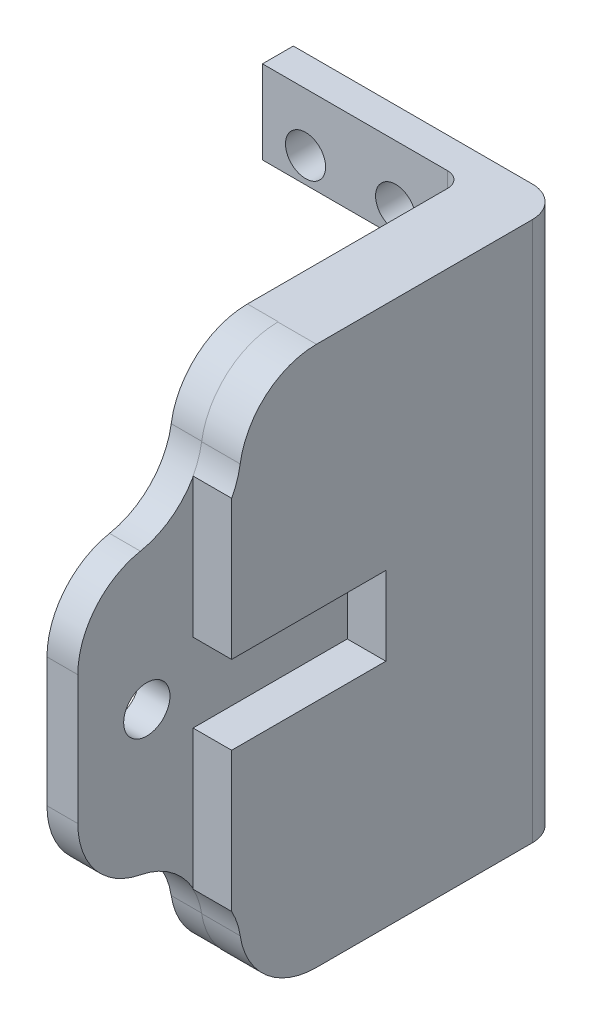
ISO-10303-21;
HEADER;
FILE_DESCRIPTION(('STEP AP214'),'2;1');
FILE_NAME('part.step','',(''),(''),'','','');
FILE_SCHEMA(('AUTOMOTIVE_DESIGN { 1 0 10303 214 1 1 1 1 }'));
ENDSEC;
DATA;
#1=APPLICATION_CONTEXT('core data for automotive mechanical design processes');
#2=APPLICATION_PROTOCOL_DEFINITION('international standard','automotive_design',2000,#1);
#3=PRODUCT_CONTEXT('',#1,'mechanical');
#4=PRODUCT('Part','Part','',(#3));
#5=PRODUCT_RELATED_PRODUCT_CATEGORY('part','',(#4));
#6=PRODUCT_DEFINITION_FORMATION('','',#4);
#7=PRODUCT_DEFINITION_CONTEXT('part definition',#1,'design');
#8=PRODUCT_DEFINITION('design','',#6,#7);
#9=PRODUCT_DEFINITION_SHAPE('','',#8);
#10=(LENGTH_UNIT() NAMED_UNIT(*) SI_UNIT(.MILLI.,.METRE.));
#11=(NAMED_UNIT(*) PLANE_ANGLE_UNIT() SI_UNIT($,.RADIAN.));
#12=(NAMED_UNIT(*) SI_UNIT($,.STERADIAN.) SOLID_ANGLE_UNIT());
#13=UNCERTAINTY_MEASURE_WITH_UNIT(LENGTH_MEASURE(1.E-05),#10,'distance_accuracy_value','');
#14=(GEOMETRIC_REPRESENTATION_CONTEXT(3) GLOBAL_UNCERTAINTY_ASSIGNED_CONTEXT((#13)) GLOBAL_UNIT_ASSIGNED_CONTEXT((#10,
#11,#12)) REPRESENTATION_CONTEXT('',''));
#15=CARTESIAN_POINT('',(0.,0.,0.));
#16=DIRECTION('',(0.,0.,1.));
#17=DIRECTION('',(1.,0.,0.));
#18=AXIS2_PLACEMENT_3D('',#15,#16,#17);
#19=CARTESIAN_POINT('',(0.,0.,-7.00000000000002));
#20=DIRECTION('',(1.,0.,0.));
#21=DIRECTION('',(0.,0.,-1.));
#22=AXIS2_PLACEMENT_3D('',#19,#20,#21);
#23=PLANE('',#22);
#24=DIRECTION('',(0.,-1.,0.));
#25=VECTOR('',#24,1.);
#26=CARTESIAN_POINT('',(0.,0.,-9.00000000000002));
#27=LINE('',#26,#25);
#28=CARTESIAN_POINT('',(0.,35.,-9.00000000000002));
#29=VERTEX_POINT('',#28);
#30=CARTESIAN_POINT('',(0.,29.6,-9.00000000000002));
#31=VERTEX_POINT('',#30);
#32=EDGE_CURVE('E239',#29,#31,#27,.T.);
#33=ORIENTED_EDGE('',*,*,#32,.T.);
#34=DIRECTION('',(0.,0.,1.));
#35=VECTOR('',#34,1.);
#36=CARTESIAN_POINT('',(0.,29.6,-9.00000000000002));
#37=LINE('',#36,#35);
#38=CARTESIAN_POINT('',(0.,29.6,-7.00000000000002));
#39=VERTEX_POINT('',#38);
#40=EDGE_CURVE('E222',#31,#39,#37,.T.);
#41=ORIENTED_EDGE('',*,*,#40,.T.);
#42=DIRECTION('',(0.,1.,0.));
#43=VECTOR('',#42,1.);
#44=CARTESIAN_POINT('',(0.,35.,-7.00000000000002));
#45=LINE('',#44,#43);
#46=CARTESIAN_POINT('',(0.,35.,-7.00000000000002));
#47=VERTEX_POINT('',#46);
#48=EDGE_CURVE('E459',#39,#47,#45,.T.);
#49=ORIENTED_EDGE('',*,*,#48,.T.);
#50=DIRECTION('',(0.,0.,-1.));
#51=VECTOR('',#50,1.);
#52=CARTESIAN_POINT('',(0.,35.,-9.00000000000002));
#53=LINE('',#52,#51);
#54=EDGE_CURVE('E247',#47,#29,#53,.T.);
#55=ORIENTED_EDGE('',*,*,#54,.T.);
#56=EDGE_LOOP('',(#33,#41,#49,#55));
#57=FACE_BOUND('',#56,.T.);
#58=ADVANCED_FACE('F33',(#57),#23,.F.);
#59=CARTESIAN_POINT('',(15.,29.1009460962562,12.5));
#60=DIRECTION('',(0.,0.,1.));
#61=DIRECTION('',(0.,-1.,0.));
#62=AXIS2_PLACEMENT_3D('',#59,#60,#61);
#63=PLANE('',#62);
#64=DIRECTION('',(1.,0.,0.));
#65=VECTOR('',#64,1.);
#66=CARTESIAN_POINT('',(15.,14.95,12.5));
#67=LINE('',#66,#65);
#68=CARTESIAN_POINT('',(15.,14.95,12.5));
#69=VERTEX_POINT('',#68);
#70=CARTESIAN_POINT('',(17.5,14.95,12.5));
#71=VERTEX_POINT('',#70);
#72=EDGE_CURVE('E468',#69,#71,#67,.T.);
#73=ORIENTED_EDGE('',*,*,#72,.F.);
#74=DIRECTION('',(0.,-1.,0.));
#75=VECTOR('',#74,1.);
#76=CARTESIAN_POINT('',(15.,29.1009460962562,12.5));
#77=LINE('',#76,#75);
#78=CARTESIAN_POINT('',(15.,5.94546996031433,12.5));
#79=VERTEX_POINT('',#78);
#80=EDGE_CURVE('E625',#69,#79,#77,.T.);
#81=ORIENTED_EDGE('',*,*,#80,.T.);
#82=CARTESIAN_POINT('',(15.,5.89905390374383,12.5));
#83=VERTEX_POINT('',#82);
#84=EDGE_CURVE('E626',#79,#83,#77,.T.);
#85=ORIENTED_EDGE('',*,*,#84,.T.);
#86=DIRECTION('',(1.,0.,0.));
#87=VECTOR('',#86,1.);
#88=CARTESIAN_POINT('',(15.,5.89905390374383,12.5));
#89=LINE('',#88,#87);
#90=CARTESIAN_POINT('',(17.5,5.89905390374383,12.5));
#91=VERTEX_POINT('',#90);
#92=EDGE_CURVE('E377',#83,#91,#89,.T.);
#93=ORIENTED_EDGE('',*,*,#92,.T.);
#94=DIRECTION('',(0.,-1.,0.));
#95=VECTOR('',#94,1.);
#96=CARTESIAN_POINT('',(17.5,29.1009460962562,12.5));
#97=LINE('',#96,#95);
#98=EDGE_CURVE('E604',#71,#91,#97,.T.);
#99=ORIENTED_EDGE('',*,*,#98,.F.);
#100=EDGE_LOOP('',(#73,#81,#85,#93,#99));
#101=FACE_BOUND('',#100,.T.);
#102=ADVANCED_FACE('F515',(#101),#63,.T.);
#103=CARTESIAN_POINT('',(13.,30.0000000000001,6.97429546204824));
#104=DIRECTION('',(1.,0.,0.));
#105=DIRECTION('',(0.,0.,-1.));
#106=AXIS2_PLACEMENT_3D('',#103,#104,#105);
#107=PLANE('',#106);
#108=CARTESIAN_POINT('',(13.,17.5,15.5));
#109=DIRECTION('',(-1.,0.,0.));
#110=DIRECTION('',(0.,0.,1.));
#111=AXIS2_PLACEMENT_3D('',#108,#109,#110);
#112=CIRCLE('',#111,1.49999999999999);
#113=CARTESIAN_POINT('',(13.,17.5,17.));
#114=VERTEX_POINT('',#113);
#115=EDGE_CURVE('E508',#114,#114,#112,.T.);
#116=ORIENTED_EDGE('',*,*,#115,.F.);
#117=EDGE_LOOP('',(#116));
#118=FACE_BOUND('',#117,.T.);
#119=DIRECTION('',(0.,0.,-1.));
#120=VECTOR('',#119,1.);
#121=CARTESIAN_POINT('',(13.,35.0000000000001,-9.00000000000002));
#122=LINE('',#121,#120);
#123=CARTESIAN_POINT('',(13.,35.0000000000001,6.97429546204824));
#124=VERTEX_POINT('',#123);
#125=CARTESIAN_POINT('',(13.,35.0000000000001,-6.00000000000012));
#126=VERTEX_POINT('',#125);
#127=EDGE_CURVE('E260',#124,#126,#122,.T.);
#128=ORIENTED_EDGE('',*,*,#127,.T.);
#129=DIRECTION('',(0.,1.,0.));
#130=VECTOR('',#129,1.);
#131=CARTESIAN_POINT('',(13.,0.,-6.00000000000012));
#132=LINE('',#131,#130);
#133=CARTESIAN_POINT('',(13.,0.,-6.00000000000012));
#134=VERTEX_POINT('',#133);
#135=EDGE_CURVE('E302',#126,#134,#132,.F.);
#136=ORIENTED_EDGE('',*,*,#135,.T.);
#137=DIRECTION('',(0.,0.,1.));
#138=VECTOR('',#137,1.);
#139=CARTESIAN_POINT('',(13.,0.,6.97429546204829));
#140=LINE('',#139,#138);
#141=CARTESIAN_POINT('',(13.,0.,6.97429546204829));
#142=VERTEX_POINT('',#141);
#143=EDGE_CURVE('E270',#134,#142,#140,.T.);
#144=ORIENTED_EDGE('',*,*,#143,.T.);
#145=CARTESIAN_POINT('',(13.,5.00000000000006,6.97429546204829));
#146=DIRECTION('',(-1.,0.,0.));
#147=DIRECTION('',(0.,0.,-1.));
#148=AXIS2_PLACEMENT_3D('',#145,#146,#147);
#149=CIRCLE('',#148,5.00000000000006);
#150=CARTESIAN_POINT('',(13.,4.25000000000005,11.9177254453696));
#151=VERTEX_POINT('',#150);
#152=EDGE_CURVE('E305',#142,#151,#149,.T.);
#153=ORIENTED_EDGE('',*,*,#152,.T.);
#154=CARTESIAN_POINT('',(13.,3.50000000000005,16.8611554286909));
#155=DIRECTION('',(1.,0.,0.));
#156=DIRECTION('',(0.,0.,1.));
#157=AXIS2_PLACEMENT_3D('',#154,#155,#156);
#158=CIRCLE('',#157,4.99999999999999);
#159=CARTESIAN_POINT('',(13.,8.4101873555467,15.9177254453696));
#160=VERTEX_POINT('',#159);
#161=EDGE_CURVE('E406',#151,#160,#158,.T.);
#162=ORIENTED_EDGE('',*,*,#161,.T.);
#163=CARTESIAN_POINT('',(13.,13.3203747110933,14.9742954620483));
#164=DIRECTION('',(-1.,0.,0.));
#165=DIRECTION('',(0.,0.,-1.));
#166=AXIS2_PLACEMENT_3D('',#163,#164,#165);
#167=CIRCLE('',#166,4.99999999999998);
#168=CARTESIAN_POINT('',(13.,13.3203747110933,19.9742954620483));
#169=VERTEX_POINT('',#168);
#170=EDGE_CURVE('E404',#160,#169,#167,.T.);
#171=ORIENTED_EDGE('',*,*,#170,.T.);
#172=DIRECTION('',(0.,1.,0.));
#173=VECTOR('',#172,1.);
#174=CARTESIAN_POINT('',(13.,21.6796252889068,19.9742954620483));
#175=LINE('',#174,#173);
#176=CARTESIAN_POINT('',(13.,21.6796252889068,19.9742954620483));
#177=VERTEX_POINT('',#176);
#178=EDGE_CURVE('E402',#169,#177,#175,.T.);
#179=ORIENTED_EDGE('',*,*,#178,.T.);
#180=CARTESIAN_POINT('',(13.,21.6796252889068,14.9742954620484));
#181=DIRECTION('',(-1.,0.,0.));
#182=DIRECTION('',(0.,0.,-1.));
#183=AXIS2_PLACEMENT_3D('',#180,#181,#182);
#184=CIRCLE('',#183,4.99999999999995);
#185=CARTESIAN_POINT('',(13.,26.5898126444534,15.9177254453696));
#186=VERTEX_POINT('',#185);
#187=EDGE_CURVE('E400',#177,#186,#184,.T.);
#188=ORIENTED_EDGE('',*,*,#187,.T.);
#189=CARTESIAN_POINT('',(13.,31.5000000000001,16.8611554286909));
#190=DIRECTION('',(1.,0.,0.));
#191=DIRECTION('',(0.,0.,1.));
#192=AXIS2_PLACEMENT_3D('',#189,#190,#191);
#193=CIRCLE('',#192,5.00000000000003);
#194=CARTESIAN_POINT('',(13.,30.7500000000001,11.9177254453696));
#195=VERTEX_POINT('',#194);
#196=EDGE_CURVE('E398',#186,#195,#193,.T.);
#197=ORIENTED_EDGE('',*,*,#196,.T.);
#198=CARTESIAN_POINT('',(13.,30.0000000000001,6.97429546204824));
#199=DIRECTION('',(-1.,0.,0.));
#200=DIRECTION('',(0.,0.,-1.));
#201=AXIS2_PLACEMENT_3D('',#198,#199,#200);
#202=CIRCLE('',#201,5.00000000000002);
#203=EDGE_CURVE('E257',#195,#124,#202,.T.);
#204=ORIENTED_EDGE('',*,*,#203,.T.);
#205=EDGE_LOOP('',(#128,#136,#144,#153,#162,#171,#179,#188,#197,#204));
#206=FACE_BOUND('',#205,.T.);
#207=ADVANCED_FACE('F410',(#118,#206),#107,.F.);
#208=CARTESIAN_POINT('',(15.,3.50000000000003,16.8868599666426));
#209=DIRECTION('',(-1.,0.,0.));
#210=DIRECTION('',(0.,0.,1.));
#211=AXIS2_PLACEMENT_3D('',#208,#209,#210);
#212=PLANE('',#211);
#213=CARTESIAN_POINT('',(15.,30.0000000000001,6.97429546204824));
#214=DIRECTION('',(-1.,0.,0.));
#215=DIRECTION('',(0.,0.,-1.));
#216=AXIS2_PLACEMENT_3D('',#213,#214,#215);
#217=CIRCLE('',#216,5.00000000000002);
#218=CARTESIAN_POINT('',(15.,30.7500000000001,11.9177254453696));
#219=VERTEX_POINT('',#218);
#220=CARTESIAN_POINT('',(15.,35.,6.97429546204824));
#221=VERTEX_POINT('',#220);
#222=EDGE_CURVE('E271',#219,#221,#217,.T.);
#223=ORIENTED_EDGE('',*,*,#222,.F.);
#224=CARTESIAN_POINT('',(15.,31.5000000000001,16.8611554286909));
#225=DIRECTION('',(1.,0.,0.));
#226=DIRECTION('',(0.,0.,1.));
#227=AXIS2_PLACEMENT_3D('',#224,#225,#226);
#228=CIRCLE('',#227,5.00000000000003);
#229=CARTESIAN_POINT('',(15.,29.0545300396857,12.5));
#230=VERTEX_POINT('',#229);
#231=EDGE_CURVE('E303',#230,#219,#228,.T.);
#232=ORIENTED_EDGE('',*,*,#231,.F.);
#233=CARTESIAN_POINT('',(15.,29.1009460962562,12.5));
#234=VERTEX_POINT('',#233);
#235=EDGE_CURVE('E620',#234,#230,#77,.T.);
#236=ORIENTED_EDGE('',*,*,#235,.F.);
#237=CARTESIAN_POINT('',(15.,31.5,16.8868599666426));
#238=DIRECTION('',(-1.,0.,0.));
#239=DIRECTION('',(0.,0.,1.));
#240=AXIS2_PLACEMENT_3D('',#237,#238,#239);
#241=CIRCLE('',#240,5.);
#242=CARTESIAN_POINT('',(15.,30.75,11.9434299833213));
#243=VERTEX_POINT('',#242);
#244=EDGE_CURVE('E632',#243,#234,#241,.T.);
#245=ORIENTED_EDGE('',*,*,#244,.F.);
#246=CARTESIAN_POINT('',(15.,29.9999999999999,6.99999999999996));
#247=DIRECTION('',(1.,0.,0.));
#248=DIRECTION('',(0.,0.,-1.));
#249=AXIS2_PLACEMENT_3D('',#246,#247,#248);
#250=CIRCLE('',#249,5.00000000000006);
#251=CARTESIAN_POINT('',(15.,35.,6.99999999999998));
#252=VERTEX_POINT('',#251);
#253=EDGE_CURVE('E635',#252,#243,#250,.T.);
#254=ORIENTED_EDGE('',*,*,#253,.F.);
#255=DIRECTION('',(0.,0.,1.));
#256=VECTOR('',#255,1.);
#257=CARTESIAN_POINT('',(15.,35.,-9.00000000000002));
#258=LINE('',#257,#256);
#259=EDGE_CURVE('E336',#221,#252,#258,.T.);
#260=ORIENTED_EDGE('',*,*,#259,.F.);
#261=EDGE_LOOP('',(#223,#232,#236,#245,#254,#260));
#262=FACE_BOUND('',#261,.T.);
#263=ADVANCED_FACE('F367',(#262),#212,.T.);
#264=CARTESIAN_POINT('',(15.,3.50000000000003,16.8868599666426));
#265=DIRECTION('',(1.,0.,0.));
#266=DIRECTION('',(0.,0.,-1.));
#267=AXIS2_PLACEMENT_3D('',#264,#265,#266);
#268=CYLINDRICAL_SURFACE('',#267,5.00000000000002);
#269=CARTESIAN_POINT('',(17.5,3.50000000000003,16.8868599666426));
#270=DIRECTION('',(-1.,0.,0.));
#271=DIRECTION('',(0.,0.,1.));
#272=AXIS2_PLACEMENT_3D('',#269,#270,#271);
#273=CIRCLE('',#272,5.00000000000002);
#274=CARTESIAN_POINT('',(17.5,4.25000000000002,11.9434299833213));
#275=VERTEX_POINT('',#274);
#276=EDGE_CURVE('E645',#91,#275,#273,.T.);
#277=ORIENTED_EDGE('',*,*,#276,.F.);
#278=ORIENTED_EDGE('',*,*,#92,.F.);
#279=CARTESIAN_POINT('',(15.,3.50000000000003,16.8868599666426));
#280=DIRECTION('',(-1.,0.,0.));
#281=DIRECTION('',(0.,0.,1.));
#282=AXIS2_PLACEMENT_3D('',#279,#280,#281);
#283=CIRCLE('',#282,5.00000000000002);
#284=CARTESIAN_POINT('',(15.,4.25000000000002,11.9434299833213));
#285=VERTEX_POINT('',#284);
#286=EDGE_CURVE('E603',#83,#285,#283,.T.);
#287=ORIENTED_EDGE('',*,*,#286,.T.);
#288=DIRECTION('',(1.,0.,0.));
#289=VECTOR('',#288,1.);
#290=CARTESIAN_POINT('',(15.,4.25000000000002,11.9434299833213));
#291=LINE('',#290,#289);
#292=EDGE_CURVE('E619',#285,#275,#291,.T.);
#293=ORIENTED_EDGE('',*,*,#292,.T.);
#294=EDGE_LOOP('',(#277,#278,#287,#293));
#295=FACE_BOUND('',#294,.T.);
#296=ADVANCED_FACE('F521',(#295),#268,.F.);
#297=DIRECTION('',(1.,0.,0.));
#298=VECTOR('',#297,1.);
#299=CARTESIAN_POINT('',(15.,20.05,12.5));
#300=LINE('',#299,#298);
#301=CARTESIAN_POINT('',(15.,20.05,12.5));
#302=VERTEX_POINT('',#301);
#303=CARTESIAN_POINT('',(17.5,20.05,12.5));
#304=VERTEX_POINT('',#303);
#305=EDGE_CURVE('E464',#302,#304,#300,.T.);
#306=ORIENTED_EDGE('',*,*,#305,.T.);
#307=CARTESIAN_POINT('',(17.5,29.1009460962562,12.5));
#308=VERTEX_POINT('',#307);
#309=EDGE_CURVE('E595',#308,#304,#97,.T.);
#310=ORIENTED_EDGE('',*,*,#309,.F.);
#311=DIRECTION('',(1.,0.,0.));
#312=VECTOR('',#311,1.);
#313=CARTESIAN_POINT('',(15.,29.1009460962562,12.5));
#314=LINE('',#313,#312);
#315=EDGE_CURVE('E380',#234,#308,#314,.T.);
#316=ORIENTED_EDGE('',*,*,#315,.F.);
#317=ORIENTED_EDGE('',*,*,#235,.T.);
#318=EDGE_CURVE('E597',#230,#302,#77,.T.);
#319=ORIENTED_EDGE('',*,*,#318,.T.);
#320=EDGE_LOOP('',(#306,#310,#316,#317,#319));
#321=FACE_BOUND('',#320,.T.);
#322=ADVANCED_FACE('F526',(#321),#63,.T.);
#323=CARTESIAN_POINT('',(15.,31.5,16.8868599666426));
#324=DIRECTION('',(1.,0.,0.));
#325=DIRECTION('',(0.,0.,-1.));
#326=AXIS2_PLACEMENT_3D('',#323,#324,#325);
#327=CYLINDRICAL_SURFACE('',#326,5.);
#328=CARTESIAN_POINT('',(17.5,31.5,16.8868599666426));
#329=DIRECTION('',(-1.,0.,0.));
#330=DIRECTION('',(0.,0.,1.));
#331=AXIS2_PLACEMENT_3D('',#328,#329,#330);
#332=CIRCLE('',#331,5.);
#333=CARTESIAN_POINT('',(17.5,30.75,11.9434299833213));
#334=VERTEX_POINT('',#333);
#335=EDGE_CURVE('E602',#334,#308,#332,.T.);
#336=ORIENTED_EDGE('',*,*,#335,.F.);
#337=DIRECTION('',(1.,0.,0.));
#338=VECTOR('',#337,1.);
#339=CARTESIAN_POINT('',(15.,30.75,11.9434299833213));
#340=LINE('',#339,#338);
#341=EDGE_CURVE('E613',#243,#334,#340,.T.);
#342=ORIENTED_EDGE('',*,*,#341,.F.);
#343=ORIENTED_EDGE('',*,*,#244,.T.);
#344=ORIENTED_EDGE('',*,*,#315,.T.);
#345=EDGE_LOOP('',(#336,#342,#343,#344));
#346=FACE_BOUND('',#345,.T.);
#347=ADVANCED_FACE('F675',(#346),#327,.F.);
#348=CARTESIAN_POINT('',(15.,29.9999999999999,6.99999999999996));
#349=DIRECTION('',(1.,0.,0.));
#350=DIRECTION('',(0.,0.,-1.));
#351=AXIS2_PLACEMENT_3D('',#348,#349,#350);
#352=CYLINDRICAL_SURFACE('',#351,5.00000000000006);
#353=CARTESIAN_POINT('',(17.5,29.9999999999999,6.99999999999996));
#354=DIRECTION('',(1.,0.,0.));
#355=DIRECTION('',(0.,0.,-1.));
#356=AXIS2_PLACEMENT_3D('',#353,#354,#355);
#357=CIRCLE('',#356,5.00000000000006);
#358=CARTESIAN_POINT('',(17.5,35.,6.99999999999998));
#359=VERTEX_POINT('',#358);
#360=EDGE_CURVE('E654',#359,#334,#357,.T.);
#361=ORIENTED_EDGE('',*,*,#360,.F.);
#362=DIRECTION('',(1.,0.,0.));
#363=VECTOR('',#362,1.);
#364=CARTESIAN_POINT('',(15.,35.,6.99999999999998));
#365=LINE('',#364,#363);
#366=EDGE_CURVE('E615',#252,#359,#365,.T.);
#367=ORIENTED_EDGE('',*,*,#366,.F.);
#368=ORIENTED_EDGE('',*,*,#253,.T.);
#369=ORIENTED_EDGE('',*,*,#341,.T.);
#370=EDGE_LOOP('',(#361,#367,#368,#369));
#371=FACE_BOUND('',#370,.T.);
#372=ADVANCED_FACE('F657',(#371),#352,.T.);
#373=CARTESIAN_POINT('',(15.,5.00000000000006,6.99999999999996));
#374=DIRECTION('',(1.,0.,0.));
#375=DIRECTION('',(0.,0.,-1.));
#376=AXIS2_PLACEMENT_3D('',#373,#374,#375);
#377=CYLINDRICAL_SURFACE('',#376,5.00000000000003);
#378=CARTESIAN_POINT('',(17.5,5.00000000000006,6.99999999999996));
#379=DIRECTION('',(1.,0.,0.));
#380=DIRECTION('',(0.,0.,-1.));
#381=AXIS2_PLACEMENT_3D('',#378,#379,#380);
#382=CIRCLE('',#381,5.00000000000003);
#383=CARTESIAN_POINT('',(17.5,0.,6.99999999999998));
#384=VERTEX_POINT('',#383);
#385=EDGE_CURVE('E651',#275,#384,#382,.T.);
#386=ORIENTED_EDGE('',*,*,#385,.F.);
#387=ORIENTED_EDGE('',*,*,#292,.F.);
#388=CARTESIAN_POINT('',(15.,5.00000000000006,6.99999999999996));
#389=DIRECTION('',(1.,0.,0.));
#390=DIRECTION('',(0.,0.,-1.));
#391=AXIS2_PLACEMENT_3D('',#388,#389,#390);
#392=CIRCLE('',#391,5.00000000000003);
#393=CARTESIAN_POINT('',(15.,0.,6.99999999999998));
#394=VERTEX_POINT('',#393);
#395=EDGE_CURVE('E607',#285,#394,#392,.T.);
#396=ORIENTED_EDGE('',*,*,#395,.T.);
#397=DIRECTION('',(1.,0.,0.));
#398=VECTOR('',#397,1.);
#399=CARTESIAN_POINT('',(15.,0.,6.99999999999998));
#400=LINE('',#399,#398);
#401=EDGE_CURVE('E617',#394,#384,#400,.T.);
#402=ORIENTED_EDGE('',*,*,#401,.T.);
#403=EDGE_LOOP('',(#386,#387,#396,#402));
#404=FACE_BOUND('',#403,.T.);
#405=ADVANCED_FACE('F650',(#404),#377,.T.);
#406=CARTESIAN_POINT('',(15.,3.50000000000005,16.8611554286909));
#407=DIRECTION('',(1.,0.,0.));
#408=DIRECTION('',(0.,0.,1.));
#409=AXIS2_PLACEMENT_3D('',#406,#407,#408);
#410=CIRCLE('',#409,4.99999999999999);
#411=CARTESIAN_POINT('',(15.,4.25000000000005,11.9177254453696));
#412=VERTEX_POINT('',#411);
#413=EDGE_CURVE('E394',#412,#79,#410,.T.);
#414=ORIENTED_EDGE('',*,*,#413,.F.);
#415=CARTESIAN_POINT('',(15.,5.00000000000006,6.97429546204829));
#416=DIRECTION('',(-1.,0.,0.));
#417=DIRECTION('',(0.,0.,-1.));
#418=AXIS2_PLACEMENT_3D('',#415,#416,#417);
#419=CIRCLE('',#418,5.00000000000006);
#420=CARTESIAN_POINT('',(15.,0.,6.97429546204829));
#421=VERTEX_POINT('',#420);
#422=EDGE_CURVE('E339',#421,#412,#419,.T.);
#423=ORIENTED_EDGE('',*,*,#422,.F.);
#424=DIRECTION('',(0.,0.,1.));
#425=VECTOR('',#424,1.);
#426=CARTESIAN_POINT('',(15.,0.,-9.00000000000002));
#427=LINE('',#426,#425);
#428=EDGE_CURVE('E323',#421,#394,#427,.T.);
#429=ORIENTED_EDGE('',*,*,#428,.T.);
#430=ORIENTED_EDGE('',*,*,#395,.F.);
#431=ORIENTED_EDGE('',*,*,#286,.F.);
#432=ORIENTED_EDGE('',*,*,#84,.F.);
#433=EDGE_LOOP('',(#414,#423,#429,#430,#431,#432));
#434=FACE_BOUND('',#433,.T.);
#435=ADVANCED_FACE('F523',(#434),#212,.T.);
#436=CARTESIAN_POINT('',(17.5,3.50000000000003,16.8868599666426));
#437=DIRECTION('',(-1.,0.,0.));
#438=DIRECTION('',(0.,0.,1.));
#439=AXIS2_PLACEMENT_3D('',#436,#437,#438);
#440=PLANE('',#439);
#441=DIRECTION('',(0.,0.,1.));
#442=VECTOR('',#441,1.);
#443=CARTESIAN_POINT('',(17.5,0.,-9.00000000000002));
#444=LINE('',#443,#442);
#445=CARTESIAN_POINT('',(17.5,0.,-7.00000000000001));
#446=VERTEX_POINT('',#445);
#447=EDGE_CURVE('E325',#446,#384,#444,.T.);
#448=ORIENTED_EDGE('',*,*,#447,.F.);
#449=DIRECTION('',(0.,-1.,0.));
#450=VECTOR('',#449,1.);
#451=CARTESIAN_POINT('',(17.5,3.50000000000003,-7.00000000000001));
#452=LINE('',#451,#450);
#453=CARTESIAN_POINT('',(17.5,35.,-7.00000000000001));
#454=VERTEX_POINT('',#453);
#455=EDGE_CURVE('E41',#446,#454,#452,.F.);
#456=ORIENTED_EDGE('',*,*,#455,.T.);
#457=DIRECTION('',(0.,0.,1.));
#458=VECTOR('',#457,1.);
#459=CARTESIAN_POINT('',(17.5,35.,-9.00000000000002));
#460=LINE('',#459,#458);
#461=EDGE_CURVE('E643',#454,#359,#460,.T.);
#462=ORIENTED_EDGE('',*,*,#461,.T.);
#463=ORIENTED_EDGE('',*,*,#360,.T.);
#464=ORIENTED_EDGE('',*,*,#335,.T.);
#465=ORIENTED_EDGE('',*,*,#309,.T.);
#466=DIRECTION('',(0.,0.,1.));
#467=VECTOR('',#466,1.);
#468=CARTESIAN_POINT('',(17.5,20.05,2.5));
#469=LINE('',#468,#467);
#470=CARTESIAN_POINT('',(17.5,20.05,2.5));
#471=VERTEX_POINT('',#470);
#472=EDGE_CURVE('E475',#471,#304,#469,.T.);
#473=ORIENTED_EDGE('',*,*,#472,.F.);
#474=DIRECTION('',(0.,1.,0.));
#475=VECTOR('',#474,1.);
#476=CARTESIAN_POINT('',(17.5,14.95,2.5));
#477=LINE('',#476,#475);
#478=CARTESIAN_POINT('',(17.5,14.95,2.5));
#479=VERTEX_POINT('',#478);
#480=EDGE_CURVE('E477',#479,#471,#477,.T.);
#481=ORIENTED_EDGE('',*,*,#480,.F.);
#482=DIRECTION('',(0.,0.,-1.));
#483=VECTOR('',#482,1.);
#484=CARTESIAN_POINT('',(17.5,14.95,12.5));
#485=LINE('',#484,#483);
#486=EDGE_CURVE('E471',#71,#479,#485,.T.);
#487=ORIENTED_EDGE('',*,*,#486,.F.);
#488=ORIENTED_EDGE('',*,*,#98,.T.);
#489=ORIENTED_EDGE('',*,*,#276,.T.);
#490=ORIENTED_EDGE('',*,*,#385,.T.);
#491=EDGE_LOOP('',(#448,#456,#462,#463,#464,#465,#473,#481,#487,#488,#489,#490));
#492=FACE_BOUND('',#491,.T.);
#493=ADVANCED_FACE('F599',(#492),#440,.F.);
#494=CARTESIAN_POINT('',(17.5,35.,-9.00000000000002));
#495=DIRECTION('',(0.,-1.,0.));
#496=DIRECTION('',(1.,0.,0.));
#497=AXIS2_PLACEMENT_3D('',#494,#495,#496);
#498=PLANE('',#497);
#499=ORIENTED_EDGE('',*,*,#461,.F.);
#500=CARTESIAN_POINT('',(15.5,35.,-7.00000000000001));
#501=DIRECTION('',(0.,-1.,0.));
#502=DIRECTION('',(1.,0.,0.));
#503=AXIS2_PLACEMENT_3D('',#500,#501,#502);
#504=CIRCLE('',#503,2.00000000000001);
#505=CARTESIAN_POINT('',(15.5,35.,-9.00000000000002));
#506=VERTEX_POINT('',#505);
#507=EDGE_CURVE('E11',#454,#506,#504,.F.);
#508=ORIENTED_EDGE('',*,*,#507,.T.);
#509=DIRECTION('',(1.,0.,0.));
#510=VECTOR('',#509,1.);
#511=CARTESIAN_POINT('',(17.5,35.,-9.00000000000002));
#512=LINE('',#511,#510);
#513=EDGE_CURVE('E317',#29,#506,#512,.T.);
#514=ORIENTED_EDGE('',*,*,#513,.F.);
#515=ORIENTED_EDGE('',*,*,#54,.F.);
#516=DIRECTION('',(1.,0.,0.));
#517=VECTOR('',#516,1.);
#518=CARTESIAN_POINT('',(0.,35.,-7.00000000000002));
#519=LINE('',#518,#517);
#520=CARTESIAN_POINT('',(12.0000000000001,35.,-7.00000000000002));
#521=VERTEX_POINT('',#520);
#522=EDGE_CURVE('E274',#47,#521,#519,.T.);
#523=ORIENTED_EDGE('',*,*,#522,.T.);
#524=CARTESIAN_POINT('',(12.0000000000001,35.,-6.00000000000012));
#525=DIRECTION('',(0.,-1.,0.));
#526=DIRECTION('',(1.,0.,0.));
#527=AXIS2_PLACEMENT_3D('',#524,#525,#526);
#528=CIRCLE('',#527,0.999999999999898);
#529=EDGE_CURVE('E307',#521,#126,#528,.T.);
#530=ORIENTED_EDGE('',*,*,#529,.T.);
#531=ORIENTED_EDGE('',*,*,#127,.F.);
#532=DIRECTION('',(1.,0.,0.));
#533=VECTOR('',#532,1.);
#534=CARTESIAN_POINT('',(13.,35.0000000000001,6.97429546204824));
#535=LINE('',#534,#533);
#536=EDGE_CURVE('E327',#124,#221,#535,.T.);
#537=ORIENTED_EDGE('',*,*,#536,.T.);
#538=ORIENTED_EDGE('',*,*,#259,.T.);
#539=ORIENTED_EDGE('',*,*,#366,.T.);
#540=EDGE_LOOP('',(#499,#508,#514,#515,#523,#530,#531,#537,#538,#539));
#541=FACE_BOUND('',#540,.T.);
#542=ADVANCED_FACE('F356',(#541),#498,.F.);
#543=CARTESIAN_POINT('',(15.,0.,-9.00000000000002));
#544=DIRECTION('',(0.,1.,0.));
#545=DIRECTION('',(-1.,0.,0.));
#546=AXIS2_PLACEMENT_3D('',#543,#544,#545);
#547=PLANE('',#546);
#548=DIRECTION('',(-1.,0.,0.));
#549=VECTOR('',#548,1.);
#550=CARTESIAN_POINT('',(15.,0.,-9.00000000000002));
#551=LINE('',#550,#549);
#552=CARTESIAN_POINT('',(15.5,0.,-9.00000000000002));
#553=VERTEX_POINT('',#552);
#554=CARTESIAN_POINT('',(0.,0.,-9.00000000000002));
#555=VERTEX_POINT('',#554);
#556=EDGE_CURVE('E316',#553,#555,#551,.T.);
#557=ORIENTED_EDGE('',*,*,#556,.F.);
#558=CARTESIAN_POINT('',(15.5,0.,-7.00000000000001));
#559=DIRECTION('',(0.,1.,0.));
#560=DIRECTION('',(-1.,0.,0.));
#561=AXIS2_PLACEMENT_3D('',#558,#559,#560);
#562=CIRCLE('',#561,2.00000000000001);
#563=EDGE_CURVE('E55',#553,#446,#562,.F.);
#564=ORIENTED_EDGE('',*,*,#563,.T.);
#565=ORIENTED_EDGE('',*,*,#447,.T.);
#566=ORIENTED_EDGE('',*,*,#401,.F.);
#567=ORIENTED_EDGE('',*,*,#428,.F.);
#568=DIRECTION('',(1.,0.,0.));
#569=VECTOR('',#568,1.);
#570=CARTESIAN_POINT('',(13.,0.,6.97429546204829));
#571=LINE('',#570,#569);
#572=EDGE_CURVE('E345',#142,#421,#571,.T.);
#573=ORIENTED_EDGE('',*,*,#572,.F.);
#574=ORIENTED_EDGE('',*,*,#143,.F.);
#575=CARTESIAN_POINT('',(12.0000000000001,0.,-6.00000000000012));
#576=DIRECTION('',(0.,1.,0.));
#577=DIRECTION('',(-1.,0.,0.));
#578=AXIS2_PLACEMENT_3D('',#575,#576,#577);
#579=CIRCLE('',#578,0.999999999999898);
#580=CARTESIAN_POINT('',(12.0000000000001,0.,-7.00000000000002));
#581=VERTEX_POINT('',#580);
#582=EDGE_CURVE('E309',#134,#581,#579,.T.);
#583=ORIENTED_EDGE('',*,*,#582,.T.);
#584=DIRECTION('',(1.,0.,0.));
#585=VECTOR('',#584,1.);
#586=CARTESIAN_POINT('',(0.,0.,-7.00000000000002));
#587=LINE('',#586,#585);
#588=CARTESIAN_POINT('',(0.,0.,-7.00000000000002));
#589=VERTEX_POINT('',#588);
#590=EDGE_CURVE('E251',#589,#581,#587,.T.);
#591=ORIENTED_EDGE('',*,*,#590,.F.);
#592=DIRECTION('',(0.,0.,1.));
#593=VECTOR('',#592,1.);
#594=CARTESIAN_POINT('',(0.,0.,-7.00000000000002));
#595=LINE('',#594,#593);
#596=EDGE_CURVE('E248',#555,#589,#595,.T.);
#597=ORIENTED_EDGE('',*,*,#596,.F.);
#598=EDGE_LOOP('',(#557,#564,#565,#566,#567,#573,#574,#583,#591,#597));
#599=FACE_BOUND('',#598,.T.);
#600=ADVANCED_FACE('F321',(#599),#547,.F.);
#601=CARTESIAN_POINT('',(15.,0.,-9.00000000000002));
#602=DIRECTION('',(0.,0.,1.));
#603=DIRECTION('',(1.,0.,0.));
#604=AXIS2_PLACEMENT_3D('',#601,#602,#603);
#605=PLANE('',#604);
#606=CARTESIAN_POINT('',(8.59360032204635,3.75,-9.00000000000002));
#607=DIRECTION('',(0.,0.,-1.));
#608=DIRECTION('',(-1.,0.,0.));
#609=AXIS2_PLACEMENT_3D('',#606,#607,#608);
#610=CIRCLE('',#609,1.29999999999999);
#611=CARTESIAN_POINT('',(7.29360032204636,3.75,-9.00000000000002));
#612=VERTEX_POINT('',#611);
#613=EDGE_CURVE('E298',#612,#612,#610,.T.);
#614=ORIENTED_EDGE('',*,*,#613,.F.);
#615=EDGE_LOOP('',(#614));
#616=FACE_BOUND('',#615,.T.);
#617=CARTESIAN_POINT('',(8.63599999999999,31.25,-9.00000000000002));
#618=DIRECTION('',(0.,0.,-1.));
#619=DIRECTION('',(-1.,0.,0.));
#620=AXIS2_PLACEMENT_3D('',#617,#618,#619);
#621=CIRCLE('',#620,1.29999999999999);
#622=CARTESIAN_POINT('',(7.336,31.25,-9.00000000000002));
#623=VERTEX_POINT('',#622);
#624=EDGE_CURVE('E294',#623,#623,#621,.T.);
#625=ORIENTED_EDGE('',*,*,#624,.F.);
#626=EDGE_LOOP('',(#625));
#627=FACE_BOUND('',#626,.T.);
#628=CARTESIAN_POINT('',(2.79399999999999,31.25,-9.00000000000002));
#629=DIRECTION('',(0.,0.,-1.));
#630=DIRECTION('',(-1.,0.,0.));
#631=AXIS2_PLACEMENT_3D('',#628,#629,#630);
#632=CIRCLE('',#631,1.29999999999999);
#633=CARTESIAN_POINT('',(1.494,31.25,-9.00000000000002));
#634=VERTEX_POINT('',#633);
#635=EDGE_CURVE('E290',#634,#634,#632,.T.);
#636=ORIENTED_EDGE('',*,*,#635,.F.);
#637=EDGE_LOOP('',(#636));
#638=FACE_BOUND('',#637,.T.);
#639=CARTESIAN_POINT('',(2.83639967795365,3.75,-9.00000000000002));
#640=DIRECTION('',(0.,0.,-1.));
#641=DIRECTION('',(-1.,0.,0.));
#642=AXIS2_PLACEMENT_3D('',#639,#640,#641);
#643=CIRCLE('',#642,1.29999999999999);
#644=CARTESIAN_POINT('',(1.53639967795366,3.75,-9.00000000000002));
#645=VERTEX_POINT('',#644);
#646=EDGE_CURVE('E286',#645,#645,#643,.T.);
#647=ORIENTED_EDGE('',*,*,#646,.F.);
#648=EDGE_LOOP('',(#647));
#649=FACE_BOUND('',#648,.T.);
#650=ORIENTED_EDGE('',*,*,#513,.T.);
#651=DIRECTION('',(0.,-1.,0.));
#652=VECTOR('',#651,1.);
#653=CARTESIAN_POINT('',(15.5,0.,-9.00000000000002));
#654=LINE('',#653,#652);
#655=EDGE_CURVE('E311',#506,#553,#654,.T.);
#656=ORIENTED_EDGE('',*,*,#655,.T.);
#657=ORIENTED_EDGE('',*,*,#556,.T.);
#658=CARTESIAN_POINT('',(0.,5.4,-9.00000000000002));
#659=VERTEX_POINT('',#658);
#660=EDGE_CURVE('E249',#659,#555,#27,.T.);
#661=ORIENTED_EDGE('',*,*,#660,.F.);
#662=DIRECTION('',(1.,0.,0.));
#663=VECTOR('',#662,1.);
#664=CARTESIAN_POINT('',(0.,5.4,-9.00000000000002));
#665=LINE('',#664,#663);
#666=CARTESIAN_POINT('',(11.43,5.4,-9.00000000000002));
#667=VERTEX_POINT('',#666);
#668=EDGE_CURVE('E242',#659,#667,#665,.T.);
#669=ORIENTED_EDGE('',*,*,#668,.T.);
#670=DIRECTION('',(0.,1.,0.));
#671=VECTOR('',#670,1.);
#672=CARTESIAN_POINT('',(11.43,5.4,-9.00000000000002));
#673=LINE('',#672,#671);
#674=CARTESIAN_POINT('',(11.43,29.6,-9.00000000000002));
#675=VERTEX_POINT('',#674);
#676=EDGE_CURVE('E233',#667,#675,#673,.T.);
#677=ORIENTED_EDGE('',*,*,#676,.T.);
#678=DIRECTION('',(-1.,0.,0.));
#679=VECTOR('',#678,1.);
#680=CARTESIAN_POINT('',(11.43,29.6,-9.00000000000002));
#681=LINE('',#680,#679);
#682=EDGE_CURVE('E225',#675,#31,#681,.T.);
#683=ORIENTED_EDGE('',*,*,#682,.T.);
#684=ORIENTED_EDGE('',*,*,#32,.F.);
#685=EDGE_LOOP('',(#650,#656,#657,#661,#669,#677,#683,#684));
#686=FACE_BOUND('',#685,.T.);
#687=ADVANCED_FACE('F238',(#616,#627,#638,#649,#686),#605,.F.);
#688=CARTESIAN_POINT('',(15.,30.0000000000001,6.97429546204824));
#689=DIRECTION('',(1.,0.,0.));
#690=DIRECTION('',(0.,0.,-1.));
#691=AXIS2_PLACEMENT_3D('',#688,#689,#690);
#692=PLANE('',#691);
#693=CARTESIAN_POINT('',(15.,17.5,15.5));
#694=DIRECTION('',(1.,0.,0.));
#695=DIRECTION('',(0.,0.,-1.));
#696=AXIS2_PLACEMENT_3D('',#693,#694,#695);
#697=CIRCLE('',#696,1.49999999999999);
#698=CARTESIAN_POINT('',(15.,17.5,14.));
#699=VERTEX_POINT('',#698);
#700=EDGE_CURVE('E505',#699,#699,#697,.T.);
#701=ORIENTED_EDGE('',*,*,#700,.F.);
#702=EDGE_LOOP('',(#701));
#703=FACE_BOUND('',#702,.T.);
#704=ORIENTED_EDGE('',*,*,#318,.F.);
#705=CARTESIAN_POINT('',(15.,26.5898126444534,15.9177254453696));
#706=VERTEX_POINT('',#705);
#707=EDGE_CURVE('E261',#706,#230,#228,.T.);
#708=ORIENTED_EDGE('',*,*,#707,.F.);
#709=CARTESIAN_POINT('',(15.,21.6796252889068,14.9742954620484));
#710=DIRECTION('',(-1.,0.,0.));
#711=DIRECTION('',(0.,0.,-1.));
#712=AXIS2_PLACEMENT_3D('',#709,#710,#711);
#713=CIRCLE('',#712,4.99999999999995);
#714=CARTESIAN_POINT('',(15.,21.6796252889068,19.9742954620483));
#715=VERTEX_POINT('',#714);
#716=EDGE_CURVE('E384',#715,#706,#713,.T.);
#717=ORIENTED_EDGE('',*,*,#716,.F.);
#718=DIRECTION('',(0.,1.,0.));
#719=VECTOR('',#718,1.);
#720=CARTESIAN_POINT('',(15.,21.6796252889068,19.9742954620483));
#721=LINE('',#720,#719);
#722=CARTESIAN_POINT('',(15.,13.3203747110933,19.9742954620483));
#723=VERTEX_POINT('',#722);
#724=EDGE_CURVE('E385',#723,#715,#721,.T.);
#725=ORIENTED_EDGE('',*,*,#724,.F.);
#726=CARTESIAN_POINT('',(15.,13.3203747110933,14.9742954620483));
#727=DIRECTION('',(-1.,0.,0.));
#728=DIRECTION('',(0.,0.,-1.));
#729=AXIS2_PLACEMENT_3D('',#726,#727,#728);
#730=CIRCLE('',#729,4.99999999999998);
#731=CARTESIAN_POINT('',(15.,8.4101873555467,15.9177254453696));
#732=VERTEX_POINT('',#731);
#733=EDGE_CURVE('E390',#732,#723,#730,.T.);
#734=ORIENTED_EDGE('',*,*,#733,.F.);
#735=EDGE_CURVE('E342',#79,#732,#410,.T.);
#736=ORIENTED_EDGE('',*,*,#735,.F.);
#737=ORIENTED_EDGE('',*,*,#80,.F.);
#738=DIRECTION('',(0.,0.,-1.));
#739=VECTOR('',#738,1.);
#740=CARTESIAN_POINT('',(15.,14.95,12.5));
#741=LINE('',#740,#739);
#742=CARTESIAN_POINT('',(15.,14.95,2.5));
#743=VERTEX_POINT('',#742);
#744=EDGE_CURVE('E465',#69,#743,#741,.T.);
#745=ORIENTED_EDGE('',*,*,#744,.T.);
#746=DIRECTION('',(0.,1.,0.));
#747=VECTOR('',#746,1.);
#748=CARTESIAN_POINT('',(15.,14.95,2.5));
#749=LINE('',#748,#747);
#750=CARTESIAN_POINT('',(15.,20.05,2.5));
#751=VERTEX_POINT('',#750);
#752=EDGE_CURVE('E474',#743,#751,#749,.T.);
#753=ORIENTED_EDGE('',*,*,#752,.T.);
#754=DIRECTION('',(0.,0.,1.));
#755=VECTOR('',#754,1.);
#756=CARTESIAN_POINT('',(15.,20.05,2.5));
#757=LINE('',#756,#755);
#758=EDGE_CURVE('E483',#751,#302,#757,.T.);
#759=ORIENTED_EDGE('',*,*,#758,.T.);
#760=EDGE_LOOP('',(#704,#708,#717,#725,#734,#736,#737,#745,#753,#759));
#761=FACE_BOUND('',#760,.T.);
#762=ADVANCED_FACE('F689',(#703,#761),#692,.T.);
#763=CARTESIAN_POINT('',(13.,30.0000000000001,6.97429546204824));
#764=DIRECTION('',(1.,0.,0.));
#765=DIRECTION('',(0.,0.,-1.));
#766=AXIS2_PLACEMENT_3D('',#763,#764,#765);
#767=CYLINDRICAL_SURFACE('',#766,5.00000000000002);
#768=ORIENTED_EDGE('',*,*,#222,.T.);
#769=ORIENTED_EDGE('',*,*,#536,.F.);
#770=ORIENTED_EDGE('',*,*,#203,.F.);
#771=DIRECTION('',(1.,0.,0.));
#772=VECTOR('',#771,1.);
#773=CARTESIAN_POINT('',(13.,30.7500000000001,11.9177254453696));
#774=LINE('',#773,#772);
#775=EDGE_CURVE('E364',#195,#219,#774,.T.);
#776=ORIENTED_EDGE('',*,*,#775,.T.);
#777=EDGE_LOOP('',(#768,#769,#770,#776));
#778=FACE_BOUND('',#777,.T.);
#779=ADVANCED_FACE('F362',(#778),#767,.T.);
#780=CARTESIAN_POINT('',(13.,5.00000000000006,6.97429546204829));
#781=DIRECTION('',(1.,0.,0.));
#782=DIRECTION('',(0.,0.,-1.));
#783=AXIS2_PLACEMENT_3D('',#780,#781,#782);
#784=CYLINDRICAL_SURFACE('',#783,5.00000000000006);
#785=ORIENTED_EDGE('',*,*,#422,.T.);
#786=DIRECTION('',(1.,0.,0.));
#787=VECTOR('',#786,1.);
#788=CARTESIAN_POINT('',(13.,4.25000000000005,11.9177254453696));
#789=LINE('',#788,#787);
#790=EDGE_CURVE('E348',#151,#412,#789,.T.);
#791=ORIENTED_EDGE('',*,*,#790,.F.);
#792=ORIENTED_EDGE('',*,*,#152,.F.);
#793=ORIENTED_EDGE('',*,*,#572,.T.);
#794=EDGE_LOOP('',(#785,#791,#792,#793));
#795=FACE_BOUND('',#794,.T.);
#796=ADVANCED_FACE('F417',(#795),#784,.T.);
#797=CARTESIAN_POINT('',(13.,3.50000000000005,16.8611554286909));
#798=DIRECTION('',(1.,0.,0.));
#799=DIRECTION('',(0.,0.,-1.));
#800=AXIS2_PLACEMENT_3D('',#797,#798,#799);
#801=CYLINDRICAL_SURFACE('',#800,4.99999999999999);
#802=ORIENTED_EDGE('',*,*,#413,.T.);
#803=ORIENTED_EDGE('',*,*,#735,.T.);
#804=DIRECTION('',(1.,0.,0.));
#805=VECTOR('',#804,1.);
#806=CARTESIAN_POINT('',(13.,8.4101873555467,15.9177254453696));
#807=LINE('',#806,#805);
#808=EDGE_CURVE('E419',#160,#732,#807,.T.);
#809=ORIENTED_EDGE('',*,*,#808,.F.);
#810=ORIENTED_EDGE('',*,*,#161,.F.);
#811=ORIENTED_EDGE('',*,*,#790,.T.);
#812=EDGE_LOOP('',(#802,#803,#809,#810,#811));
#813=FACE_BOUND('',#812,.T.);
#814=ADVANCED_FACE('F420',(#813),#801,.F.);
#815=CARTESIAN_POINT('',(13.,13.3203747110933,14.9742954620483));
#816=DIRECTION('',(1.,0.,0.));
#817=DIRECTION('',(0.,0.,-1.));
#818=AXIS2_PLACEMENT_3D('',#815,#816,#817);
#819=CYLINDRICAL_SURFACE('',#818,4.99999999999998);
#820=ORIENTED_EDGE('',*,*,#733,.T.);
#821=DIRECTION('',(1.,0.,0.));
#822=VECTOR('',#821,1.);
#823=CARTESIAN_POINT('',(13.,13.3203747110933,19.9742954620483));
#824=LINE('',#823,#822);
#825=EDGE_CURVE('E426',#169,#723,#824,.T.);
#826=ORIENTED_EDGE('',*,*,#825,.F.);
#827=ORIENTED_EDGE('',*,*,#170,.F.);
#828=ORIENTED_EDGE('',*,*,#808,.T.);
#829=EDGE_LOOP('',(#820,#826,#827,#828));
#830=FACE_BOUND('',#829,.T.);
#831=ADVANCED_FACE('F429',(#830),#819,.T.);
#832=CARTESIAN_POINT('',(13.,21.6796252889068,19.9742954620483));
#833=DIRECTION('',(0.,0.,-1.));
#834=DIRECTION('',(0.,1.,0.));
#835=AXIS2_PLACEMENT_3D('',#832,#833,#834);
#836=PLANE('',#835);
#837=ORIENTED_EDGE('',*,*,#724,.T.);
#838=DIRECTION('',(1.,0.,0.));
#839=VECTOR('',#838,1.);
#840=CARTESIAN_POINT('',(13.,21.6796252889068,19.9742954620483));
#841=LINE('',#840,#839);
#842=EDGE_CURVE('E435',#177,#715,#841,.T.);
#843=ORIENTED_EDGE('',*,*,#842,.F.);
#844=ORIENTED_EDGE('',*,*,#178,.F.);
#845=ORIENTED_EDGE('',*,*,#825,.T.);
#846=EDGE_LOOP('',(#837,#843,#844,#845));
#847=FACE_BOUND('',#846,.T.);
#848=ADVANCED_FACE('F436',(#847),#836,.F.);
#849=CARTESIAN_POINT('',(13.,21.6796252889068,14.9742954620484));
#850=DIRECTION('',(1.,0.,0.));
#851=DIRECTION('',(0.,0.,-1.));
#852=AXIS2_PLACEMENT_3D('',#849,#850,#851);
#853=CYLINDRICAL_SURFACE('',#852,4.99999999999995);
#854=ORIENTED_EDGE('',*,*,#716,.T.);
#855=DIRECTION('',(1.,0.,0.));
#856=VECTOR('',#855,1.);
#857=CARTESIAN_POINT('',(13.,26.5898126444534,15.9177254453696));
#858=LINE('',#857,#856);
#859=EDGE_CURVE('E438',#186,#706,#858,.T.);
#860=ORIENTED_EDGE('',*,*,#859,.F.);
#861=ORIENTED_EDGE('',*,*,#187,.F.);
#862=ORIENTED_EDGE('',*,*,#842,.T.);
#863=EDGE_LOOP('',(#854,#860,#861,#862));
#864=FACE_BOUND('',#863,.T.);
#865=ADVANCED_FACE('F440',(#864),#853,.T.);
#866=CARTESIAN_POINT('',(13.,31.5000000000001,16.8611554286909));
#867=DIRECTION('',(1.,0.,0.));
#868=DIRECTION('',(0.,0.,-1.));
#869=AXIS2_PLACEMENT_3D('',#866,#867,#868);
#870=CYLINDRICAL_SURFACE('',#869,5.00000000000003);
#871=ORIENTED_EDGE('',*,*,#707,.T.);
#872=ORIENTED_EDGE('',*,*,#231,.T.);
#873=ORIENTED_EDGE('',*,*,#775,.F.);
#874=ORIENTED_EDGE('',*,*,#196,.F.);
#875=ORIENTED_EDGE('',*,*,#859,.T.);
#876=EDGE_LOOP('',(#871,#872,#873,#874,#875));
#877=FACE_BOUND('',#876,.T.);
#878=ADVANCED_FACE('F373',(#877),#870,.F.);
#879=CARTESIAN_POINT('',(0.,35.,-7.00000000000002));
#880=DIRECTION('',(0.,0.,-1.));
#881=DIRECTION('',(0.,1.,0.));
#882=AXIS2_PLACEMENT_3D('',#879,#880,#881);
#883=PLANE('',#882);
#884=CARTESIAN_POINT('',(8.59360032204635,3.75,-7.00000000000002));
#885=DIRECTION('',(0.,0.,-1.));
#886=DIRECTION('',(0.,1.,0.));
#887=AXIS2_PLACEMENT_3D('',#884,#885,#886);
#888=CIRCLE('',#887,1.29999999999999);
#889=CARTESIAN_POINT('',(8.59360032204635,5.04999999999999,-7.00000000000002));
#890=VERTEX_POINT('',#889);
#891=EDGE_CURVE('E295',#890,#890,#888,.T.);
#892=ORIENTED_EDGE('',*,*,#891,.T.);
#893=EDGE_LOOP('',(#892));
#894=FACE_BOUND('',#893,.T.);
#895=CARTESIAN_POINT('',(8.63599999999999,31.25,-7.00000000000002));
#896=DIRECTION('',(0.,0.,-1.));
#897=DIRECTION('',(0.,1.,0.));
#898=AXIS2_PLACEMENT_3D('',#895,#896,#897);
#899=CIRCLE('',#898,1.29999999999999);
#900=CARTESIAN_POINT('',(8.63599999999999,32.55,-7.00000000000002));
#901=VERTEX_POINT('',#900);
#902=EDGE_CURVE('E291',#901,#901,#899,.T.);
#903=ORIENTED_EDGE('',*,*,#902,.T.);
#904=EDGE_LOOP('',(#903));
#905=FACE_BOUND('',#904,.T.);
#906=CARTESIAN_POINT('',(2.79399999999999,31.25,-7.00000000000002));
#907=DIRECTION('',(0.,0.,-1.));
#908=DIRECTION('',(0.,1.,0.));
#909=AXIS2_PLACEMENT_3D('',#906,#907,#908);
#910=CIRCLE('',#909,1.29999999999999);
#911=CARTESIAN_POINT('',(2.79399999999999,32.55,-7.00000000000002));
#912=VERTEX_POINT('',#911);
#913=EDGE_CURVE('E287',#912,#912,#910,.T.);
#914=ORIENTED_EDGE('',*,*,#913,.T.);
#915=EDGE_LOOP('',(#914));
#916=FACE_BOUND('',#915,.T.);
#917=CARTESIAN_POINT('',(2.83639967795365,3.75,-7.00000000000002));
#918=DIRECTION('',(0.,0.,-1.));
#919=DIRECTION('',(0.,1.,0.));
#920=AXIS2_PLACEMENT_3D('',#917,#918,#919);
#921=CIRCLE('',#920,1.29999999999999);
#922=CARTESIAN_POINT('',(2.83639967795365,5.04999999999999,-7.00000000000002));
#923=VERTEX_POINT('',#922);
#924=EDGE_CURVE('E283',#923,#923,#921,.T.);
#925=ORIENTED_EDGE('',*,*,#924,.T.);
#926=EDGE_LOOP('',(#925));
#927=FACE_BOUND('',#926,.T.);
#928=ORIENTED_EDGE('',*,*,#590,.T.);
#929=DIRECTION('',(0.,1.,0.));
#930=VECTOR('',#929,1.);
#931=CARTESIAN_POINT('',(12.0000000000001,35.,-7.00000000000002));
#932=LINE('',#931,#930);
#933=EDGE_CURVE('E299',#581,#521,#932,.T.);
#934=ORIENTED_EDGE('',*,*,#933,.T.);
#935=ORIENTED_EDGE('',*,*,#522,.F.);
#936=ORIENTED_EDGE('',*,*,#48,.F.);
#937=DIRECTION('',(-1.,0.,0.));
#938=VECTOR('',#937,1.);
#939=CARTESIAN_POINT('',(11.43,29.6,-7.00000000000002));
#940=LINE('',#939,#938);
#941=CARTESIAN_POINT('',(11.43,29.6,-7.00000000000002));
#942=VERTEX_POINT('',#941);
#943=EDGE_CURVE('E228',#942,#39,#940,.T.);
#944=ORIENTED_EDGE('',*,*,#943,.F.);
#945=DIRECTION('',(0.,1.,0.));
#946=VECTOR('',#945,1.);
#947=CARTESIAN_POINT('',(11.43,5.4,-7.00000000000002));
#948=LINE('',#947,#946);
#949=CARTESIAN_POINT('',(11.43,5.4,-7.00000000000002));
#950=VERTEX_POINT('',#949);
#951=EDGE_CURVE('E243',#950,#942,#948,.T.);
#952=ORIENTED_EDGE('',*,*,#951,.F.);
#953=DIRECTION('',(1.,0.,0.));
#954=VECTOR('',#953,1.);
#955=CARTESIAN_POINT('',(0.,5.4,-7.00000000000002));
#956=LINE('',#955,#954);
#957=CARTESIAN_POINT('',(0.,5.4,-7.00000000000002));
#958=VERTEX_POINT('',#957);
#959=EDGE_CURVE('E456',#958,#950,#956,.T.);
#960=ORIENTED_EDGE('',*,*,#959,.F.);
#961=EDGE_CURVE('E453',#589,#958,#45,.T.);
#962=ORIENTED_EDGE('',*,*,#961,.F.);
#963=EDGE_LOOP('',(#928,#934,#935,#936,#944,#952,#960,#962));
#964=FACE_BOUND('',#963,.T.);
#965=ADVANCED_FACE('F449',(#894,#905,#916,#927,#964),#883,.F.);
#966=ORIENTED_EDGE('',*,*,#961,.T.);
#967=DIRECTION('',(0.,0.,1.));
#968=VECTOR('',#967,1.);
#969=CARTESIAN_POINT('',(0.,5.4,-9.00000000000002));
#970=LINE('',#969,#968);
#971=EDGE_CURVE('E232',#659,#958,#970,.T.);
#972=ORIENTED_EDGE('',*,*,#971,.F.);
#973=ORIENTED_EDGE('',*,*,#660,.T.);
#974=ORIENTED_EDGE('',*,*,#596,.T.);
#975=EDGE_LOOP('',(#966,#972,#973,#974));
#976=FACE_BOUND('',#975,.T.);
#977=ADVANCED_FACE('F531',(#976),#23,.F.);
#978=CARTESIAN_POINT('',(15.,14.95,2.5));
#979=DIRECTION('',(0.,0.,-1.));
#980=DIRECTION('',(0.,1.,0.));
#981=AXIS2_PLACEMENT_3D('',#978,#979,#980);
#982=PLANE('',#981);
#983=ORIENTED_EDGE('',*,*,#480,.T.);
#984=DIRECTION('',(1.,0.,0.));
#985=VECTOR('',#984,1.);
#986=CARTESIAN_POINT('',(15.,20.05,2.5));
#987=LINE('',#986,#985);
#988=EDGE_CURVE('E462',#751,#471,#987,.T.);
#989=ORIENTED_EDGE('',*,*,#988,.F.);
#990=ORIENTED_EDGE('',*,*,#752,.F.);
#991=DIRECTION('',(1.,0.,0.));
#992=VECTOR('',#991,1.);
#993=CARTESIAN_POINT('',(15.,14.95,2.5));
#994=LINE('',#993,#992);
#995=EDGE_CURVE('E460',#743,#479,#994,.T.);
#996=ORIENTED_EDGE('',*,*,#995,.T.);
#997=EDGE_LOOP('',(#983,#989,#990,#996));
#998=FACE_BOUND('',#997,.T.);
#999=ADVANCED_FACE('F536',(#998),#982,.F.);
#1000=CARTESIAN_POINT('',(15.,14.95,12.5));
#1001=DIRECTION('',(0.,-1.,0.));
#1002=DIRECTION('',(0.,0.,-1.));
#1003=AXIS2_PLACEMENT_3D('',#1000,#1001,#1002);
#1004=PLANE('',#1003);
#1005=ORIENTED_EDGE('',*,*,#486,.T.);
#1006=ORIENTED_EDGE('',*,*,#995,.F.);
#1007=ORIENTED_EDGE('',*,*,#744,.F.);
#1008=ORIENTED_EDGE('',*,*,#72,.T.);
#1009=EDGE_LOOP('',(#1005,#1006,#1007,#1008));
#1010=FACE_BOUND('',#1009,.T.);
#1011=ADVANCED_FACE('F541',(#1010),#1004,.F.);
#1012=CARTESIAN_POINT('',(15.,20.05,2.5));
#1013=DIRECTION('',(0.,1.,0.));
#1014=DIRECTION('',(0.,0.,1.));
#1015=AXIS2_PLACEMENT_3D('',#1012,#1013,#1014);
#1016=PLANE('',#1015);
#1017=ORIENTED_EDGE('',*,*,#472,.T.);
#1018=ORIENTED_EDGE('',*,*,#305,.F.);
#1019=ORIENTED_EDGE('',*,*,#758,.F.);
#1020=ORIENTED_EDGE('',*,*,#988,.T.);
#1021=EDGE_LOOP('',(#1017,#1018,#1019,#1020));
#1022=FACE_BOUND('',#1021,.T.);
#1023=ADVANCED_FACE('F579',(#1022),#1016,.F.);
#1024=CARTESIAN_POINT('',(11.43,29.6,-9.00000000000002));
#1025=DIRECTION('',(0.,1.,0.));
#1026=DIRECTION('',(0.,0.,1.));
#1027=AXIS2_PLACEMENT_3D('',#1024,#1025,#1026);
#1028=PLANE('',#1027);
#1029=ORIENTED_EDGE('',*,*,#943,.T.);
#1030=ORIENTED_EDGE('',*,*,#40,.F.);
#1031=ORIENTED_EDGE('',*,*,#682,.F.);
#1032=DIRECTION('',(0.,0.,1.));
#1033=VECTOR('',#1032,1.);
#1034=CARTESIAN_POINT('',(11.43,29.6,-9.00000000000002));
#1035=LINE('',#1034,#1033);
#1036=EDGE_CURVE('E480',#675,#942,#1035,.T.);
#1037=ORIENTED_EDGE('',*,*,#1036,.T.);
#1038=EDGE_LOOP('',(#1029,#1030,#1031,#1037));
#1039=FACE_BOUND('',#1038,.T.);
#1040=ADVANCED_FACE('F224',(#1039),#1028,.F.);
#1041=CARTESIAN_POINT('',(11.43,5.4,-9.00000000000002));
#1042=DIRECTION('',(1.,0.,0.));
#1043=DIRECTION('',(0.,0.,-1.));
#1044=AXIS2_PLACEMENT_3D('',#1041,#1042,#1043);
#1045=PLANE('',#1044);
#1046=ORIENTED_EDGE('',*,*,#951,.T.);
#1047=ORIENTED_EDGE('',*,*,#1036,.F.);
#1048=ORIENTED_EDGE('',*,*,#676,.F.);
#1049=DIRECTION('',(0.,0.,1.));
#1050=VECTOR('',#1049,1.);
#1051=CARTESIAN_POINT('',(11.43,5.4,-9.00000000000002));
#1052=LINE('',#1051,#1050);
#1053=EDGE_CURVE('E488',#667,#950,#1052,.T.);
#1054=ORIENTED_EDGE('',*,*,#1053,.T.);
#1055=EDGE_LOOP('',(#1046,#1047,#1048,#1054));
#1056=FACE_BOUND('',#1055,.T.);
#1057=ADVANCED_FACE('F569',(#1056),#1045,.F.);
#1058=CARTESIAN_POINT('',(0.,5.4,-9.00000000000002));
#1059=DIRECTION('',(0.,-1.,0.));
#1060=DIRECTION('',(0.,0.,-1.));
#1061=AXIS2_PLACEMENT_3D('',#1058,#1059,#1060);
#1062=PLANE('',#1061);
#1063=ORIENTED_EDGE('',*,*,#959,.T.);
#1064=ORIENTED_EDGE('',*,*,#1053,.F.);
#1065=ORIENTED_EDGE('',*,*,#668,.F.);
#1066=ORIENTED_EDGE('',*,*,#971,.T.);
#1067=EDGE_LOOP('',(#1063,#1064,#1065,#1066));
#1068=FACE_BOUND('',#1067,.T.);
#1069=ADVANCED_FACE('F559',(#1068),#1062,.F.);
#1070=CARTESIAN_POINT('',(2.83639967795365,3.75,-9.00000000000002));
#1071=DIRECTION('',(0.,0.,-1.));
#1072=DIRECTION('',(-1.,0.,0.));
#1073=AXIS2_PLACEMENT_3D('',#1070,#1071,#1072);
#1074=CYLINDRICAL_SURFACE('',#1073,1.29999999999999);
#1075=ORIENTED_EDGE('',*,*,#646,.T.);
#1076=EDGE_LOOP('',(#1075));
#1077=FACE_BOUND('',#1076,.T.);
#1078=ORIENTED_EDGE('',*,*,#924,.F.);
#1079=EDGE_LOOP('',(#1078));
#1080=FACE_BOUND('',#1079,.T.);
#1081=ADVANCED_FACE('F556',(#1077,#1080),#1074,.F.);
#1082=CARTESIAN_POINT('',(2.79399999999999,31.25,-9.00000000000002));
#1083=DIRECTION('',(0.,0.,-1.));
#1084=DIRECTION('',(-1.,0.,0.));
#1085=AXIS2_PLACEMENT_3D('',#1082,#1083,#1084);
#1086=CYLINDRICAL_SURFACE('',#1085,1.29999999999999);
#1087=ORIENTED_EDGE('',*,*,#635,.T.);
#1088=EDGE_LOOP('',(#1087));
#1089=FACE_BOUND('',#1088,.T.);
#1090=ORIENTED_EDGE('',*,*,#913,.F.);
#1091=EDGE_LOOP('',(#1090));
#1092=FACE_BOUND('',#1091,.T.);
#1093=ADVANCED_FACE('F558',(#1089,#1092),#1086,.F.);
#1094=CARTESIAN_POINT('',(8.63599999999999,31.25,-9.00000000000002));
#1095=DIRECTION('',(0.,0.,-1.));
#1096=DIRECTION('',(-1.,0.,0.));
#1097=AXIS2_PLACEMENT_3D('',#1094,#1095,#1096);
#1098=CYLINDRICAL_SURFACE('',#1097,1.29999999999999);
#1099=ORIENTED_EDGE('',*,*,#624,.T.);
#1100=EDGE_LOOP('',(#1099));
#1101=FACE_BOUND('',#1100,.T.);
#1102=ORIENTED_EDGE('',*,*,#902,.F.);
#1103=EDGE_LOOP('',(#1102));
#1104=FACE_BOUND('',#1103,.T.);
#1105=ADVANCED_FACE('F566',(#1101,#1104),#1098,.F.);
#1106=CARTESIAN_POINT('',(8.59360032204635,3.75,-9.00000000000002));
#1107=DIRECTION('',(0.,0.,-1.));
#1108=DIRECTION('',(-1.,0.,0.));
#1109=AXIS2_PLACEMENT_3D('',#1106,#1107,#1108);
#1110=CYLINDRICAL_SURFACE('',#1109,1.29999999999999);
#1111=ORIENTED_EDGE('',*,*,#613,.T.);
#1112=EDGE_LOOP('',(#1111));
#1113=FACE_BOUND('',#1112,.T.);
#1114=ORIENTED_EDGE('',*,*,#891,.F.);
#1115=EDGE_LOOP('',(#1114));
#1116=FACE_BOUND('',#1115,.T.);
#1117=ADVANCED_FACE('F665',(#1113,#1116),#1110,.F.);
#1118=CARTESIAN_POINT('',(13.,17.5,15.5));
#1119=DIRECTION('',(-1.,0.,0.));
#1120=DIRECTION('',(0.,0.,1.));
#1121=AXIS2_PLACEMENT_3D('',#1118,#1119,#1120);
#1122=CYLINDRICAL_SURFACE('',#1121,1.49999999999999);
#1123=ORIENTED_EDGE('',*,*,#700,.T.);
#1124=EDGE_LOOP('',(#1123));
#1125=FACE_BOUND('',#1124,.T.);
#1126=ORIENTED_EDGE('',*,*,#115,.T.);
#1127=EDGE_LOOP('',(#1126));
#1128=FACE_BOUND('',#1127,.T.);
#1129=ADVANCED_FACE('F512',(#1125,#1128),#1122,.F.);
#1130=CARTESIAN_POINT('',(12.0000000000001,35.,-6.00000000000012));
#1131=DIRECTION('',(0.,-1.,0.));
#1132=DIRECTION('',(0.,0.,-1.));
#1133=AXIS2_PLACEMENT_3D('',#1130,#1131,#1132);
#1134=CYLINDRICAL_SURFACE('',#1133,0.999999999999898);
#1135=ORIENTED_EDGE('',*,*,#582,.F.);
#1136=ORIENTED_EDGE('',*,*,#135,.F.);
#1137=ORIENTED_EDGE('',*,*,#529,.F.);
#1138=ORIENTED_EDGE('',*,*,#933,.F.);
#1139=EDGE_LOOP('',(#1135,#1136,#1137,#1138));
#1140=FACE_BOUND('',#1139,.T.);
#1141=ADVANCED_FACE('F445',(#1140),#1134,.F.);
#1142=CARTESIAN_POINT('',(15.5,0.,-7.00000000000001));
#1143=DIRECTION('',(0.,-1.,0.));
#1144=DIRECTION('',(0.,0.,-1.));
#1145=AXIS2_PLACEMENT_3D('',#1142,#1143,#1144);
#1146=CYLINDRICAL_SURFACE('',#1145,2.00000000000001);
#1147=ORIENTED_EDGE('',*,*,#507,.F.);
#1148=ORIENTED_EDGE('',*,*,#455,.F.);
#1149=ORIENTED_EDGE('',*,*,#563,.F.);
#1150=ORIENTED_EDGE('',*,*,#655,.F.);
#1151=EDGE_LOOP('',(#1147,#1148,#1149,#1150));
#1152=FACE_BOUND('',#1151,.T.);
#1153=ADVANCED_FACE('F35',(#1152),#1146,.T.);
#1154=CLOSED_SHELL('',(#58,#102,#207,#263,#296,#322,#347,#372,#405,#435,#493,#542,#600,#687,
#762,#779,#796,#814,#831,#848,#865,#878,#965,#977,#999,#1011,#1023,#1040,#1057,#1069,#1081,
#1093,#1105,#1117,#1129,#1141,#1153));
#1155=MANIFOLD_SOLID_BREP('B2',#1154);
#1156=ADVANCED_BREP_SHAPE_REPRESENTATION('',(#18,#1155),#14);
#1157=SHAPE_DEFINITION_REPRESENTATION(#9,#1156);
ENDSEC;
END-ISO-10303-21;
